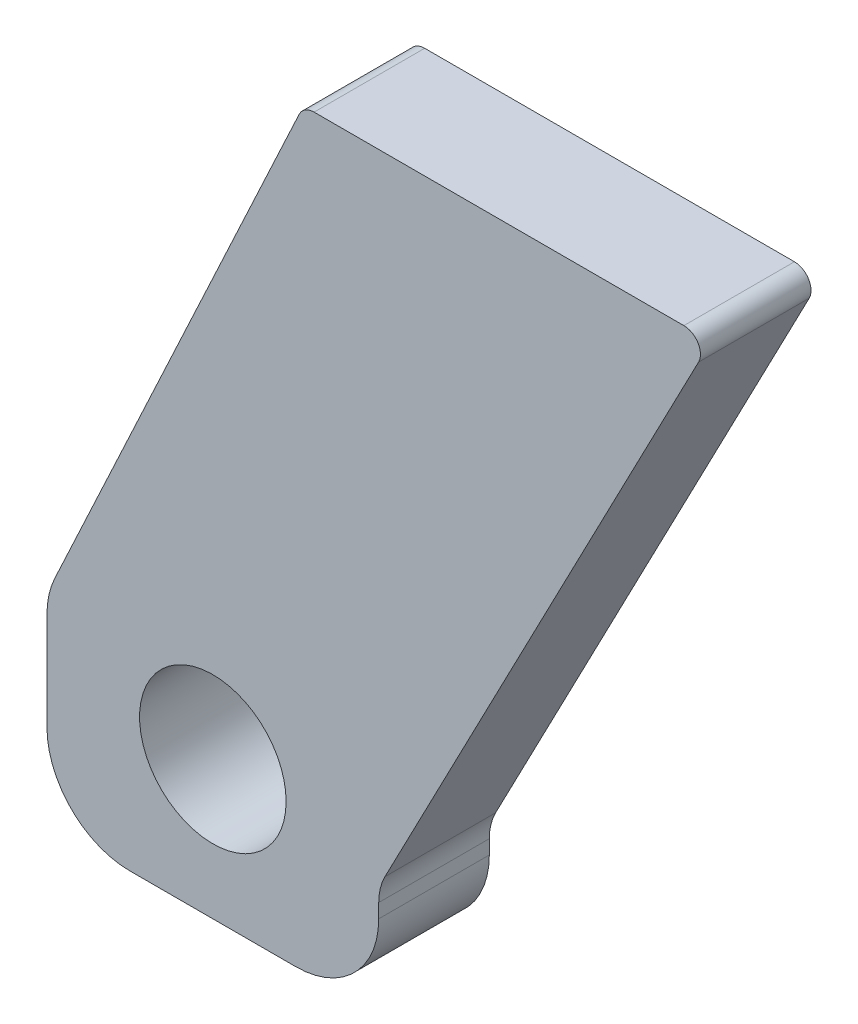
ISO-10303-21;
HEADER;
FILE_DESCRIPTION(('STEP AP214'),'2;1');
FILE_NAME('part.step','',(''),(''),'','','');
FILE_SCHEMA(('AUTOMOTIVE_DESIGN { 1 0 10303 214 1 1 1 1 }'));
ENDSEC;
DATA;
#1=APPLICATION_CONTEXT('core data for automotive mechanical design processes');
#2=APPLICATION_PROTOCOL_DEFINITION('international standard','automotive_design',2000,#1);
#3=PRODUCT_CONTEXT('',#1,'mechanical');
#4=PRODUCT('Part','Part','',(#3));
#5=PRODUCT_RELATED_PRODUCT_CATEGORY('part','',(#4));
#6=PRODUCT_DEFINITION_FORMATION('','',#4);
#7=PRODUCT_DEFINITION_CONTEXT('part definition',#1,'design');
#8=PRODUCT_DEFINITION('design','',#6,#7);
#9=PRODUCT_DEFINITION_SHAPE('','',#8);
#10=(LENGTH_UNIT() NAMED_UNIT(*) SI_UNIT(.MILLI.,.METRE.));
#11=(NAMED_UNIT(*) PLANE_ANGLE_UNIT() SI_UNIT($,.RADIAN.));
#12=(NAMED_UNIT(*) SI_UNIT($,.STERADIAN.) SOLID_ANGLE_UNIT());
#13=UNCERTAINTY_MEASURE_WITH_UNIT(LENGTH_MEASURE(1.E-05),#10,'distance_accuracy_value','');
#14=(GEOMETRIC_REPRESENTATION_CONTEXT(3) GLOBAL_UNCERTAINTY_ASSIGNED_CONTEXT((#13)) GLOBAL_UNIT_ASSIGNED_CONTEXT((#10,
#11,#12)) REPRESENTATION_CONTEXT('',''));
#15=CARTESIAN_POINT('',(0.,0.,0.));
#16=DIRECTION('',(0.,0.,1.));
#17=DIRECTION('',(1.,0.,0.));
#18=AXIS2_PLACEMENT_3D('',#15,#16,#17);
#19=CARTESIAN_POINT('',(15.,-9.99999999999999,20.));
#20=DIRECTION('',(0.,0.,1.));
#21=DIRECTION('',(1.,0.,0.));
#22=AXIS2_PLACEMENT_3D('',#19,#20,#21);
#23=PLANE('',#22);
#24=CARTESIAN_POINT('',(15.,-9.99999999999999,20.));
#25=DIRECTION('',(0.,0.,1.));
#26=DIRECTION('',(1.,0.,0.));
#27=AXIS2_PLACEMENT_3D('',#24,#25,#26);
#28=CIRCLE('',#27,15.);
#29=CARTESIAN_POINT('',(15.,-25.,20.));
#30=VERTEX_POINT('',#29);
#31=CARTESIAN_POINT('',(30.,-9.99999999999999,20.));
#32=VERTEX_POINT('',#31);
#33=EDGE_CURVE('E183',#30,#32,#28,.T.);
#34=ORIENTED_EDGE('',*,*,#33,.T.);
#35=DIRECTION('',(0.,1.,0.));
#36=VECTOR('',#35,1.);
#37=CARTESIAN_POINT('',(30.,-7.44698443229035,20.));
#38=LINE('',#37,#36);
#39=CARTESIAN_POINT('',(30.,-7.44698443229035,20.));
#40=VERTEX_POINT('',#39);
#41=EDGE_CURVE('E111',#32,#40,#38,.T.);
#42=ORIENTED_EDGE('',*,*,#41,.T.);
#43=CARTESIAN_POINT('',(40.,-7.4469844322903,20.));
#44=DIRECTION('',(0.,0.,-1.));
#45=DIRECTION('',(1.,0.,0.));
#46=AXIS2_PLACEMENT_3D('',#43,#44,#45);
#47=CIRCLE('',#46,10.);
#48=CARTESIAN_POINT('',(31.1298916682178,-2.82949829993999,20.));
#49=VERTEX_POINT('',#48);
#50=EDGE_CURVE('E210',#40,#49,#47,.T.);
#51=ORIENTED_EDGE('',*,*,#50,.T.);
#52=DIRECTION('',(0.461748613235028,0.887010833178225,0.));
#53=VECTOR('',#52,1.);
#54=CARTESIAN_POINT('',(31.1298916682178,-2.82949829993999,20.));
#55=LINE('',#54,#53);
#56=CARTESIAN_POINT('',(87.8426798460062,106.114754160295,20.));
#57=VERTEX_POINT('',#56);
#58=EDGE_CURVE('E229',#49,#57,#55,.T.);
#59=ORIENTED_EDGE('',*,*,#58,.T.);
#60=CARTESIAN_POINT('',(85.1816473464715,107.5,20.));
#61=DIRECTION('',(0.,0.,1.));
#62=DIRECTION('',(-1.,0.,0.));
#63=AXIS2_PLACEMENT_3D('',#60,#61,#62);
#64=CIRCLE('',#63,3.);
#65=CARTESIAN_POINT('',(85.1816473464715,110.5,20.));
#66=VERTEX_POINT('',#65);
#67=EDGE_CURVE('E226',#57,#66,#64,.T.);
#68=ORIENTED_EDGE('',*,*,#67,.T.);
#69=DIRECTION('',(-1.,0.,0.));
#70=VECTOR('',#69,1.);
#71=CARTESIAN_POINT('',(18.3088227688441,110.5,20.));
#72=LINE('',#71,#70);
#73=CARTESIAN_POINT('',(18.3088227688441,110.5,20.));
#74=VERTEX_POINT('',#73);
#75=EDGE_CURVE('E228',#66,#74,#72,.T.);
#76=ORIENTED_EDGE('',*,*,#75,.T.);
#77=CARTESIAN_POINT('',(18.3088227688441,107.5,20.));
#78=DIRECTION('',(0.,0.,1.));
#79=DIRECTION('',(-1.,0.,0.));
#80=AXIS2_PLACEMENT_3D('',#77,#78,#79);
#81=CIRCLE('',#80,3.);
#82=CARTESIAN_POINT('',(15.5898994077341,108.767854785222,20.));
#83=VERTEX_POINT('',#82);
#84=EDGE_CURVE('E231',#74,#83,#81,.T.);
#85=ORIENTED_EDGE('',*,*,#84,.T.);
#86=DIRECTION('',(-0.422618261740694,-0.906307787036653,0.));
#87=VECTOR('',#86,1.);
#88=CARTESIAN_POINT('',(-28.5946168055498,14.0138539864664,20.));
#89=LINE('',#88,#87);
#90=CARTESIAN_POINT('',(-28.5946168055498,14.0138539864664,20.));
#91=VERTEX_POINT('',#90);
#92=EDGE_CURVE('E237',#83,#91,#89,.T.);
#93=ORIENTED_EDGE('',*,*,#92,.T.);
#94=CARTESIAN_POINT('',(-15.,7.67458006035596,20.));
#95=DIRECTION('',(0.,0.,1.));
#96=DIRECTION('',(1.,0.,0.));
#97=AXIS2_PLACEMENT_3D('',#94,#95,#96);
#98=CIRCLE('',#97,15.);
#99=CARTESIAN_POINT('',(-30.,7.67458006035594,20.));
#100=VERTEX_POINT('',#99);
#101=EDGE_CURVE('E142',#91,#100,#98,.T.);
#102=ORIENTED_EDGE('',*,*,#101,.T.);
#103=DIRECTION('',(0.,-1.,0.));
#104=VECTOR('',#103,1.);
#105=CARTESIAN_POINT('',(-30.,7.67458006035594,20.));
#106=LINE('',#105,#104);
#107=CARTESIAN_POINT('',(-30.,-10.,20.));
#108=VERTEX_POINT('',#107);
#109=EDGE_CURVE('E136',#100,#108,#106,.T.);
#110=ORIENTED_EDGE('',*,*,#109,.T.);
#111=CARTESIAN_POINT('',(-15.,-10.,20.));
#112=DIRECTION('',(0.,0.,1.));
#113=DIRECTION('',(-1.,0.,0.));
#114=AXIS2_PLACEMENT_3D('',#111,#112,#113);
#115=CIRCLE('',#114,15.);
#116=CARTESIAN_POINT('',(-15.,-25.,20.));
#117=VERTEX_POINT('',#116);
#118=EDGE_CURVE('E140',#108,#117,#115,.T.);
#119=ORIENTED_EDGE('',*,*,#118,.T.);
#120=DIRECTION('',(1.,0.,0.));
#121=VECTOR('',#120,1.);
#122=CARTESIAN_POINT('',(15.,-25.,20.));
#123=LINE('',#122,#121);
#124=EDGE_CURVE('E56',#117,#30,#123,.T.);
#125=ORIENTED_EDGE('',*,*,#124,.T.);
#126=EDGE_LOOP('',(#34,#42,#51,#59,#68,#76,#85,#93,#102,#110,#119,#125));
#127=FACE_BOUND('',#126,.T.);
#128=CARTESIAN_POINT('',(0.,0.,20.));
#129=DIRECTION('',(0.,0.,1.));
#130=DIRECTION('',(1.,0.,0.));
#131=AXIS2_PLACEMENT_3D('',#128,#129,#130);
#132=CIRCLE('',#131,13.25);
#133=CARTESIAN_POINT('',(13.25,0.,20.));
#134=VERTEX_POINT('',#133);
#135=EDGE_CURVE('E164',#134,#134,#132,.T.);
#136=ORIENTED_EDGE('',*,*,#135,.F.);
#137=EDGE_LOOP('',(#136));
#138=FACE_BOUND('',#137,.T.);
#139=ADVANCED_FACE('F39',(#127,#138),#23,.T.);
#140=CARTESIAN_POINT('',(15.,-9.99999999999999,0.));
#141=DIRECTION('',(0.,0.,1.));
#142=DIRECTION('',(1.,0.,0.));
#143=AXIS2_PLACEMENT_3D('',#140,#141,#142);
#144=PLANE('',#143);
#145=CARTESIAN_POINT('',(15.,-9.99999999999999,0.));
#146=DIRECTION('',(0.,0.,1.));
#147=DIRECTION('',(1.,0.,0.));
#148=AXIS2_PLACEMENT_3D('',#145,#146,#147);
#149=CIRCLE('',#148,15.);
#150=CARTESIAN_POINT('',(15.,-25.,0.));
#151=VERTEX_POINT('',#150);
#152=CARTESIAN_POINT('',(30.,-9.99999999999999,0.));
#153=VERTEX_POINT('',#152);
#154=EDGE_CURVE('E160',#151,#153,#149,.T.);
#155=ORIENTED_EDGE('',*,*,#154,.F.);
#156=DIRECTION('',(1.,0.,0.));
#157=VECTOR('',#156,1.);
#158=CARTESIAN_POINT('',(15.,-25.,0.));
#159=LINE('',#158,#157);
#160=CARTESIAN_POINT('',(-15.,-25.,0.));
#161=VERTEX_POINT('',#160);
#162=EDGE_CURVE('E103',#161,#151,#159,.T.);
#163=ORIENTED_EDGE('',*,*,#162,.F.);
#164=CARTESIAN_POINT('',(-15.,-10.,0.));
#165=DIRECTION('',(0.,0.,1.));
#166=DIRECTION('',(-1.,0.,0.));
#167=AXIS2_PLACEMENT_3D('',#164,#165,#166);
#168=CIRCLE('',#167,15.);
#169=CARTESIAN_POINT('',(-30.,-10.,0.));
#170=VERTEX_POINT('',#169);
#171=EDGE_CURVE('E97',#170,#161,#168,.T.);
#172=ORIENTED_EDGE('',*,*,#171,.F.);
#173=DIRECTION('',(0.,-1.,0.));
#174=VECTOR('',#173,1.);
#175=CARTESIAN_POINT('',(-30.,7.67458006035594,0.));
#176=LINE('',#175,#174);
#177=CARTESIAN_POINT('',(-30.,7.67458006035594,0.));
#178=VERTEX_POINT('',#177);
#179=EDGE_CURVE('E150',#178,#170,#176,.T.);
#180=ORIENTED_EDGE('',*,*,#179,.F.);
#181=CARTESIAN_POINT('',(-15.,7.67458006035596,0.));
#182=DIRECTION('',(0.,0.,1.));
#183=DIRECTION('',(1.,0.,0.));
#184=AXIS2_PLACEMENT_3D('',#181,#182,#183);
#185=CIRCLE('',#184,15.);
#186=CARTESIAN_POINT('',(-28.5946168055498,14.0138539864664,0.));
#187=VERTEX_POINT('',#186);
#188=EDGE_CURVE('E178',#187,#178,#185,.T.);
#189=ORIENTED_EDGE('',*,*,#188,.F.);
#190=DIRECTION('',(-0.422618261740694,-0.906307787036653,0.));
#191=VECTOR('',#190,1.);
#192=CARTESIAN_POINT('',(-28.5946168055498,14.0138539864664,0.));
#193=LINE('',#192,#191);
#194=CARTESIAN_POINT('',(15.5898994077341,108.767854785222,0.));
#195=VERTEX_POINT('',#194);
#196=EDGE_CURVE('E176',#195,#187,#193,.T.);
#197=ORIENTED_EDGE('',*,*,#196,.F.);
#198=CARTESIAN_POINT('',(18.3088227688441,107.5,0.));
#199=DIRECTION('',(0.,0.,1.));
#200=DIRECTION('',(-1.,0.,0.));
#201=AXIS2_PLACEMENT_3D('',#198,#199,#200);
#202=CIRCLE('',#201,3.);
#203=CARTESIAN_POINT('',(18.3088227688441,110.5,0.));
#204=VERTEX_POINT('',#203);
#205=EDGE_CURVE('E174',#204,#195,#202,.T.);
#206=ORIENTED_EDGE('',*,*,#205,.F.);
#207=DIRECTION('',(-1.,0.,0.));
#208=VECTOR('',#207,1.);
#209=CARTESIAN_POINT('',(18.3088227688441,110.5,0.));
#210=LINE('',#209,#208);
#211=CARTESIAN_POINT('',(85.1816473464715,110.5,0.));
#212=VERTEX_POINT('',#211);
#213=EDGE_CURVE('E172',#212,#204,#210,.T.);
#214=ORIENTED_EDGE('',*,*,#213,.F.);
#215=CARTESIAN_POINT('',(85.1816473464715,107.5,0.));
#216=DIRECTION('',(0.,0.,1.));
#217=DIRECTION('',(-1.,0.,0.));
#218=AXIS2_PLACEMENT_3D('',#215,#216,#217);
#219=CIRCLE('',#218,3.);
#220=CARTESIAN_POINT('',(87.8426798460062,106.114754160295,0.));
#221=VERTEX_POINT('',#220);
#222=EDGE_CURVE('E170',#221,#212,#219,.T.);
#223=ORIENTED_EDGE('',*,*,#222,.F.);
#224=DIRECTION('',(0.461748613235028,0.887010833178225,0.));
#225=VECTOR('',#224,1.);
#226=CARTESIAN_POINT('',(31.1298916682178,-2.82949829993999,0.));
#227=LINE('',#226,#225);
#228=CARTESIAN_POINT('',(31.1298916682178,-2.82949829993999,0.));
#229=VERTEX_POINT('',#228);
#230=EDGE_CURVE('E168',#229,#221,#227,.T.);
#231=ORIENTED_EDGE('',*,*,#230,.F.);
#232=CARTESIAN_POINT('',(40.,-7.4469844322903,0.));
#233=DIRECTION('',(0.,0.,-1.));
#234=DIRECTION('',(1.,0.,0.));
#235=AXIS2_PLACEMENT_3D('',#232,#233,#234);
#236=CIRCLE('',#235,10.);
#237=CARTESIAN_POINT('',(30.,-7.44698443229035,0.));
#238=VERTEX_POINT('',#237);
#239=EDGE_CURVE('E166',#238,#229,#236,.T.);
#240=ORIENTED_EDGE('',*,*,#239,.F.);
#241=DIRECTION('',(0.,1.,0.));
#242=VECTOR('',#241,1.);
#243=CARTESIAN_POINT('',(30.,-7.44698443229035,0.));
#244=LINE('',#243,#242);
#245=EDGE_CURVE('E163',#153,#238,#244,.T.);
#246=ORIENTED_EDGE('',*,*,#245,.F.);
#247=EDGE_LOOP('',(#155,#163,#172,#180,#189,#197,#206,#214,#223,#231,#240,#246));
#248=FACE_BOUND('',#247,.T.);
#249=CARTESIAN_POINT('',(0.,0.,0.));
#250=DIRECTION('',(0.,0.,1.));
#251=DIRECTION('',(1.,0.,0.));
#252=AXIS2_PLACEMENT_3D('',#249,#250,#251);
#253=CIRCLE('',#252,13.25);
#254=CARTESIAN_POINT('',(13.25,0.,0.));
#255=VERTEX_POINT('',#254);
#256=EDGE_CURVE('E354',#255,#255,#253,.T.);
#257=ORIENTED_EDGE('',*,*,#256,.T.);
#258=EDGE_LOOP('',(#257));
#259=FACE_BOUND('',#258,.T.);
#260=ADVANCED_FACE('F214',(#248,#259),#144,.F.);
#261=CARTESIAN_POINT('',(15.,-9.99999999999999,20.));
#262=DIRECTION('',(0.,0.,-1.));
#263=DIRECTION('',(-1.,0.,0.));
#264=AXIS2_PLACEMENT_3D('',#261,#262,#263);
#265=CYLINDRICAL_SURFACE('',#264,15.);
#266=ORIENTED_EDGE('',*,*,#154,.T.);
#267=DIRECTION('',(0.,0.,-1.));
#268=VECTOR('',#267,1.);
#269=CARTESIAN_POINT('',(30.,-9.99999999999999,20.));
#270=LINE('',#269,#268);
#271=EDGE_CURVE('E11',#32,#153,#270,.T.);
#272=ORIENTED_EDGE('',*,*,#271,.F.);
#273=ORIENTED_EDGE('',*,*,#33,.F.);
#274=DIRECTION('',(0.,0.,-1.));
#275=VECTOR('',#274,1.);
#276=CARTESIAN_POINT('',(15.,-25.,20.));
#277=LINE('',#276,#275);
#278=EDGE_CURVE('E156',#30,#151,#277,.T.);
#279=ORIENTED_EDGE('',*,*,#278,.T.);
#280=EDGE_LOOP('',(#266,#272,#273,#279));
#281=FACE_BOUND('',#280,.T.);
#282=ADVANCED_FACE('F41',(#281),#265,.T.);
#283=CARTESIAN_POINT('',(30.,-7.44698443229035,20.));
#284=DIRECTION('',(-1.,0.,0.));
#285=DIRECTION('',(0.,-1.,0.));
#286=AXIS2_PLACEMENT_3D('',#283,#284,#285);
#287=PLANE('',#286);
#288=ORIENTED_EDGE('',*,*,#245,.T.);
#289=DIRECTION('',(0.,0.,-1.));
#290=VECTOR('',#289,1.);
#291=CARTESIAN_POINT('',(30.,-7.44698443229035,20.));
#292=LINE('',#291,#290);
#293=EDGE_CURVE('E48',#40,#238,#292,.T.);
#294=ORIENTED_EDGE('',*,*,#293,.F.);
#295=ORIENTED_EDGE('',*,*,#41,.F.);
#296=ORIENTED_EDGE('',*,*,#271,.T.);
#297=EDGE_LOOP('',(#288,#294,#295,#296));
#298=FACE_BOUND('',#297,.T.);
#299=ADVANCED_FACE('F271',(#298),#287,.F.);
#300=CARTESIAN_POINT('',(40.,-7.4469844322903,20.));
#301=DIRECTION('',(0.,0.,-1.));
#302=DIRECTION('',(-1.,0.,0.));
#303=AXIS2_PLACEMENT_3D('',#300,#301,#302);
#304=CYLINDRICAL_SURFACE('',#303,10.);
#305=ORIENTED_EDGE('',*,*,#239,.T.);
#306=DIRECTION('',(0.,0.,-1.));
#307=VECTOR('',#306,1.);
#308=CARTESIAN_POINT('',(31.1298916682178,-2.82949829993999,20.));
#309=LINE('',#308,#307);
#310=EDGE_CURVE('E202',#49,#229,#309,.T.);
#311=ORIENTED_EDGE('',*,*,#310,.F.);
#312=ORIENTED_EDGE('',*,*,#50,.F.);
#313=ORIENTED_EDGE('',*,*,#293,.T.);
#314=EDGE_LOOP('',(#305,#311,#312,#313));
#315=FACE_BOUND('',#314,.T.);
#316=ADVANCED_FACE('F208',(#315),#304,.F.);
#317=CARTESIAN_POINT('',(31.1298916682178,-2.82949829993999,20.));
#318=DIRECTION('',(-0.887010833178225,0.461748613235028,0.));
#319=DIRECTION('',(-0.461748613235028,-0.887010833178225,0.));
#320=AXIS2_PLACEMENT_3D('',#317,#318,#319);
#321=PLANE('',#320);
#322=ORIENTED_EDGE('',*,*,#230,.T.);
#323=DIRECTION('',(0.,0.,-1.));
#324=VECTOR('',#323,1.);
#325=CARTESIAN_POINT('',(87.8426798460062,106.114754160295,20.));
#326=LINE('',#325,#324);
#327=EDGE_CURVE('E199',#57,#221,#326,.T.);
#328=ORIENTED_EDGE('',*,*,#327,.F.);
#329=ORIENTED_EDGE('',*,*,#58,.F.);
#330=ORIENTED_EDGE('',*,*,#310,.T.);
#331=EDGE_LOOP('',(#322,#328,#329,#330));
#332=FACE_BOUND('',#331,.T.);
#333=ADVANCED_FACE('F220',(#332),#321,.F.);
#334=CARTESIAN_POINT('',(85.1816473464715,107.5,20.));
#335=DIRECTION('',(0.,0.,-1.));
#336=DIRECTION('',(-1.,0.,0.));
#337=AXIS2_PLACEMENT_3D('',#334,#335,#336);
#338=CYLINDRICAL_SURFACE('',#337,3.);
#339=ORIENTED_EDGE('',*,*,#222,.T.);
#340=DIRECTION('',(0.,0.,-1.));
#341=VECTOR('',#340,1.);
#342=CARTESIAN_POINT('',(85.1816473464715,110.5,20.));
#343=LINE('',#342,#341);
#344=EDGE_CURVE('E196',#66,#212,#343,.T.);
#345=ORIENTED_EDGE('',*,*,#344,.F.);
#346=ORIENTED_EDGE('',*,*,#67,.F.);
#347=ORIENTED_EDGE('',*,*,#327,.T.);
#348=EDGE_LOOP('',(#339,#345,#346,#347));
#349=FACE_BOUND('',#348,.T.);
#350=ADVANCED_FACE('F224',(#349),#338,.T.);
#351=CARTESIAN_POINT('',(18.3088227688441,110.5,20.));
#352=DIRECTION('',(0.,-1.,0.));
#353=DIRECTION('',(0.,0.,-1.));
#354=AXIS2_PLACEMENT_3D('',#351,#352,#353);
#355=PLANE('',#354);
#356=ORIENTED_EDGE('',*,*,#213,.T.);
#357=DIRECTION('',(0.,0.,-1.));
#358=VECTOR('',#357,1.);
#359=CARTESIAN_POINT('',(18.3088227688441,110.5,20.));
#360=LINE('',#359,#358);
#361=EDGE_CURVE('E193',#74,#204,#360,.T.);
#362=ORIENTED_EDGE('',*,*,#361,.F.);
#363=ORIENTED_EDGE('',*,*,#75,.F.);
#364=ORIENTED_EDGE('',*,*,#344,.T.);
#365=EDGE_LOOP('',(#356,#362,#363,#364));
#366=FACE_BOUND('',#365,.T.);
#367=ADVANCED_FACE('F284',(#366),#355,.F.);
#368=CARTESIAN_POINT('',(18.3088227688441,107.5,20.));
#369=DIRECTION('',(0.,0.,-1.));
#370=DIRECTION('',(-1.,0.,0.));
#371=AXIS2_PLACEMENT_3D('',#368,#369,#370);
#372=CYLINDRICAL_SURFACE('',#371,3.);
#373=ORIENTED_EDGE('',*,*,#205,.T.);
#374=DIRECTION('',(0.,0.,-1.));
#375=VECTOR('',#374,1.);
#376=CARTESIAN_POINT('',(15.5898994077341,108.767854785222,20.));
#377=LINE('',#376,#375);
#378=EDGE_CURVE('E190',#83,#195,#377,.T.);
#379=ORIENTED_EDGE('',*,*,#378,.F.);
#380=ORIENTED_EDGE('',*,*,#84,.F.);
#381=ORIENTED_EDGE('',*,*,#361,.T.);
#382=EDGE_LOOP('',(#373,#379,#380,#381));
#383=FACE_BOUND('',#382,.T.);
#384=ADVANCED_FACE('F287',(#383),#372,.T.);
#385=CARTESIAN_POINT('',(-28.5946168055498,14.0138539864664,20.));
#386=DIRECTION('',(0.906307787036653,-0.422618261740694,0.));
#387=DIRECTION('',(0.422618261740694,0.906307787036653,0.));
#388=AXIS2_PLACEMENT_3D('',#385,#386,#387);
#389=PLANE('',#388);
#390=ORIENTED_EDGE('',*,*,#196,.T.);
#391=DIRECTION('',(0.,0.,-1.));
#392=VECTOR('',#391,1.);
#393=CARTESIAN_POINT('',(-28.5946168055498,14.0138539864664,20.));
#394=LINE('',#393,#392);
#395=EDGE_CURVE('E187',#91,#187,#394,.T.);
#396=ORIENTED_EDGE('',*,*,#395,.F.);
#397=ORIENTED_EDGE('',*,*,#92,.F.);
#398=ORIENTED_EDGE('',*,*,#378,.T.);
#399=EDGE_LOOP('',(#390,#396,#397,#398));
#400=FACE_BOUND('',#399,.T.);
#401=ADVANCED_FACE('F243',(#400),#389,.F.);
#402=CARTESIAN_POINT('',(-15.,7.67458006035596,20.));
#403=DIRECTION('',(0.,0.,-1.));
#404=DIRECTION('',(-1.,0.,0.));
#405=AXIS2_PLACEMENT_3D('',#402,#403,#404);
#406=CYLINDRICAL_SURFACE('',#405,15.);
#407=ORIENTED_EDGE('',*,*,#188,.T.);
#408=DIRECTION('',(0.,0.,-1.));
#409=VECTOR('',#408,1.);
#410=CARTESIAN_POINT('',(-30.,7.67458006035594,20.));
#411=LINE('',#410,#409);
#412=EDGE_CURVE('E151',#100,#178,#411,.T.);
#413=ORIENTED_EDGE('',*,*,#412,.F.);
#414=ORIENTED_EDGE('',*,*,#101,.F.);
#415=ORIENTED_EDGE('',*,*,#395,.T.);
#416=EDGE_LOOP('',(#407,#413,#414,#415));
#417=FACE_BOUND('',#416,.T.);
#418=ADVANCED_FACE('F247',(#417),#406,.T.);
#419=CARTESIAN_POINT('',(-30.,7.67458006035594,20.));
#420=DIRECTION('',(1.,0.,0.));
#421=DIRECTION('',(0.,0.,-1.));
#422=AXIS2_PLACEMENT_3D('',#419,#420,#421);
#423=PLANE('',#422);
#424=ORIENTED_EDGE('',*,*,#179,.T.);
#425=DIRECTION('',(0.,0.,-1.));
#426=VECTOR('',#425,1.);
#427=CARTESIAN_POINT('',(-30.,-10.,20.));
#428=LINE('',#427,#426);
#429=EDGE_CURVE('E147',#108,#170,#428,.T.);
#430=ORIENTED_EDGE('',*,*,#429,.F.);
#431=ORIENTED_EDGE('',*,*,#109,.F.);
#432=ORIENTED_EDGE('',*,*,#412,.T.);
#433=EDGE_LOOP('',(#424,#430,#431,#432));
#434=FACE_BOUND('',#433,.T.);
#435=ADVANCED_FACE('F148',(#434),#423,.F.);
#436=CARTESIAN_POINT('',(-15.,-10.,20.));
#437=DIRECTION('',(0.,0.,-1.));
#438=DIRECTION('',(-1.,0.,0.));
#439=AXIS2_PLACEMENT_3D('',#436,#437,#438);
#440=CYLINDRICAL_SURFACE('',#439,15.);
#441=ORIENTED_EDGE('',*,*,#171,.T.);
#442=DIRECTION('',(0.,0.,-1.));
#443=VECTOR('',#442,1.);
#444=CARTESIAN_POINT('',(-15.,-25.,20.));
#445=LINE('',#444,#443);
#446=EDGE_CURVE('E152',#117,#161,#445,.T.);
#447=ORIENTED_EDGE('',*,*,#446,.F.);
#448=ORIENTED_EDGE('',*,*,#118,.F.);
#449=ORIENTED_EDGE('',*,*,#429,.T.);
#450=EDGE_LOOP('',(#441,#447,#448,#449));
#451=FACE_BOUND('',#450,.T.);
#452=ADVANCED_FACE('F154',(#451),#440,.T.);
#453=CARTESIAN_POINT('',(15.,-25.,20.));
#454=DIRECTION('',(0.,1.,0.));
#455=DIRECTION('',(0.,0.,1.));
#456=AXIS2_PLACEMENT_3D('',#453,#454,#455);
#457=PLANE('',#456);
#458=ORIENTED_EDGE('',*,*,#162,.T.);
#459=ORIENTED_EDGE('',*,*,#278,.F.);
#460=ORIENTED_EDGE('',*,*,#124,.F.);
#461=ORIENTED_EDGE('',*,*,#446,.T.);
#462=EDGE_LOOP('',(#458,#459,#460,#461));
#463=FACE_BOUND('',#462,.T.);
#464=ADVANCED_FACE('F251',(#463),#457,.F.);
#465=CARTESIAN_POINT('',(0.,0.,20.));
#466=DIRECTION('',(0.,0.,-1.));
#467=DIRECTION('',(-1.,0.,0.));
#468=AXIS2_PLACEMENT_3D('',#465,#466,#467);
#469=CYLINDRICAL_SURFACE('',#468,13.25);
#470=ORIENTED_EDGE('',*,*,#135,.T.);
#471=EDGE_LOOP('',(#470));
#472=FACE_BOUND('',#471,.T.);
#473=ORIENTED_EDGE('',*,*,#256,.F.);
#474=EDGE_LOOP('',(#473));
#475=FACE_BOUND('',#474,.T.);
#476=ADVANCED_FACE('F253',(#472,#475),#469,.F.);
#477=CLOSED_SHELL('',(#139,#260,#282,#299,#316,#333,#350,#367,#384,#401,#418,#435,#452,#464,#476));
#478=MANIFOLD_SOLID_BREP('B2',#477);
#479=ADVANCED_BREP_SHAPE_REPRESENTATION('',(#18,#478),#14);
#480=SHAPE_DEFINITION_REPRESENTATION(#9,#479);
ENDSEC;
END-ISO-10303-21;
